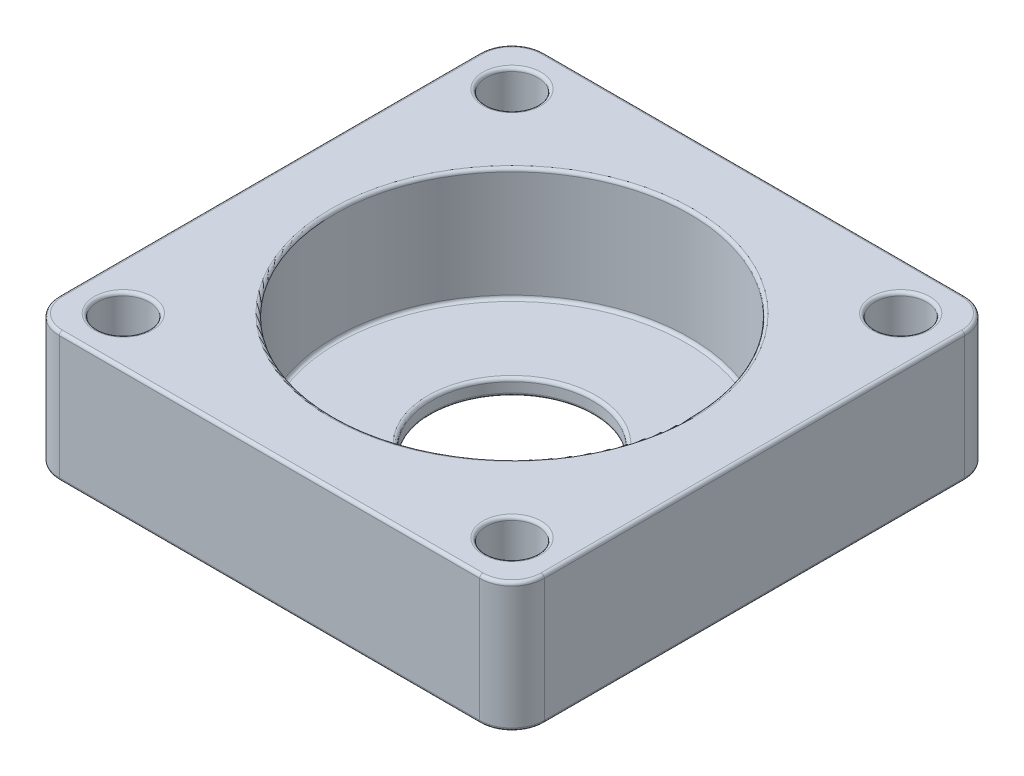
ISO-10303-21;
HEADER;
FILE_DESCRIPTION(('STEP AP214'),'2;1');
FILE_NAME('part.step','',(''),(''),'','','');
FILE_SCHEMA(('AUTOMOTIVE_DESIGN { 1 0 10303 214 1 1 1 1 }'));
ENDSEC;
DATA;
#1=APPLICATION_CONTEXT('core data for automotive mechanical design processes');
#2=APPLICATION_PROTOCOL_DEFINITION('international standard','automotive_design',2000,#1);
#3=PRODUCT_CONTEXT('',#1,'mechanical');
#4=PRODUCT('Part','Part','',(#3));
#5=PRODUCT_RELATED_PRODUCT_CATEGORY('part','',(#4));
#6=PRODUCT_DEFINITION_FORMATION('','',#4);
#7=PRODUCT_DEFINITION_CONTEXT('part definition',#1,'design');
#8=PRODUCT_DEFINITION('design','',#6,#7);
#9=PRODUCT_DEFINITION_SHAPE('','',#8);
#10=(LENGTH_UNIT() NAMED_UNIT(*) SI_UNIT(.MILLI.,.METRE.));
#11=(NAMED_UNIT(*) PLANE_ANGLE_UNIT() SI_UNIT($,.RADIAN.));
#12=(NAMED_UNIT(*) SI_UNIT($,.STERADIAN.) SOLID_ANGLE_UNIT());
#13=UNCERTAINTY_MEASURE_WITH_UNIT(LENGTH_MEASURE(1.E-05),#10,'distance_accuracy_value','');
#14=(GEOMETRIC_REPRESENTATION_CONTEXT(3) GLOBAL_UNCERTAINTY_ASSIGNED_CONTEXT((#13)) GLOBAL_UNIT_ASSIGNED_CONTEXT((#10,
#11,#12)) REPRESENTATION_CONTEXT('',''));
#15=CARTESIAN_POINT('',(0.,0.,0.));
#16=DIRECTION('',(0.,0.,1.));
#17=DIRECTION('',(1.,0.,0.));
#18=AXIS2_PLACEMENT_3D('',#15,#16,#17);
#19=CARTESIAN_POINT('',(0.,-8.,0.));
#20=DIRECTION('',(0.,1.,0.));
#21=DIRECTION('',(0.,0.,1.));
#22=AXIS2_PLACEMENT_3D('',#19,#20,#21);
#23=CYLINDRICAL_SURFACE('',#22,5.);
#24=CARTESIAN_POINT('',(0.,-7.8,0.));
#25=DIRECTION('',(0.,1.,0.));
#26=DIRECTION('',(0.,0.,1.));
#27=AXIS2_PLACEMENT_3D('',#24,#25,#26);
#28=CIRCLE('',#27,5.);
#29=CARTESIAN_POINT('',(0.,-7.8,5.));
#30=VERTEX_POINT('',#29);
#31=EDGE_CURVE('E190',#30,#30,#28,.F.);
#32=ORIENTED_EDGE('',*,*,#31,.T.);
#33=EDGE_LOOP('',(#32));
#34=FACE_BOUND('',#33,.T.);
#35=CARTESIAN_POINT('',(0.,-7.2,0.));
#36=DIRECTION('',(0.,1.,0.));
#37=DIRECTION('',(0.,0.,1.));
#38=AXIS2_PLACEMENT_3D('',#35,#36,#37);
#39=CIRCLE('',#38,5.);
#40=CARTESIAN_POINT('',(0.,-7.2,5.));
#41=VERTEX_POINT('',#40);
#42=EDGE_CURVE('E187',#41,#41,#39,.T.);
#43=ORIENTED_EDGE('',*,*,#42,.T.);
#44=EDGE_LOOP('',(#43));
#45=FACE_BOUND('',#44,.T.);
#46=ADVANCED_FACE('F34',(#34,#45),#23,.F.);
#47=CARTESIAN_POINT('',(15.,-8.,0.));
#48=DIRECTION('',(-1.,0.,0.));
#49=DIRECTION('',(0.,0.,1.));
#50=AXIS2_PLACEMENT_3D('',#47,#48,#49);
#51=PLANE('',#50);
#52=DIRECTION('',(0.,1.,0.));
#53=VECTOR('',#52,1.);
#54=CARTESIAN_POINT('',(15.,-8.,13.));
#55=LINE('',#54,#53);
#56=CARTESIAN_POINT('',(15.,-0.2,13.));
#57=VERTEX_POINT('',#56);
#58=CARTESIAN_POINT('',(15.,-7.8,13.));
#59=VERTEX_POINT('',#58);
#60=EDGE_CURVE('E348',#57,#59,#55,.F.);
#61=ORIENTED_EDGE('',*,*,#60,.T.);
#62=DIRECTION('',(0.,0.,1.));
#63=VECTOR('',#62,1.);
#64=CARTESIAN_POINT('',(15.,-7.8,0.));
#65=LINE('',#64,#63);
#66=CARTESIAN_POINT('',(15.,-7.8,-13.));
#67=VERTEX_POINT('',#66);
#68=EDGE_CURVE('E229',#59,#67,#65,.F.);
#69=ORIENTED_EDGE('',*,*,#68,.T.);
#70=DIRECTION('',(0.,1.,0.));
#71=VECTOR('',#70,1.);
#72=CARTESIAN_POINT('',(15.,-8.,-13.));
#73=LINE('',#72,#71);
#74=CARTESIAN_POINT('',(15.,-0.2,-13.));
#75=VERTEX_POINT('',#74);
#76=EDGE_CURVE('E341',#67,#75,#73,.T.);
#77=ORIENTED_EDGE('',*,*,#76,.T.);
#78=DIRECTION('',(0.,0.,1.));
#79=VECTOR('',#78,1.);
#80=CARTESIAN_POINT('',(15.,-0.2,13.));
#81=LINE('',#80,#79);
#82=EDGE_CURVE('E227',#75,#57,#81,.T.);
#83=ORIENTED_EDGE('',*,*,#82,.T.);
#84=EDGE_LOOP('',(#61,#69,#77,#83));
#85=FACE_BOUND('',#84,.T.);
#86=ADVANCED_FACE('F346',(#85),#51,.F.);
#87=CARTESIAN_POINT('',(0.,-8.,15.));
#88=DIRECTION('',(0.,0.,1.));
#89=DIRECTION('',(1.,0.,0.));
#90=AXIS2_PLACEMENT_3D('',#87,#88,#89);
#91=PLANE('',#90);
#92=DIRECTION('',(0.,1.,0.));
#93=VECTOR('',#92,1.);
#94=CARTESIAN_POINT('',(-13.,-8.,15.));
#95=LINE('',#94,#93);
#96=CARTESIAN_POINT('',(-13.,-0.2,15.));
#97=VERTEX_POINT('',#96);
#98=CARTESIAN_POINT('',(-13.,-7.8,15.));
#99=VERTEX_POINT('',#98);
#100=EDGE_CURVE('E303',#97,#99,#95,.F.);
#101=ORIENTED_EDGE('',*,*,#100,.T.);
#102=DIRECTION('',(1.,0.,0.));
#103=VECTOR('',#102,1.);
#104=CARTESIAN_POINT('',(13.,-7.8,15.));
#105=LINE('',#104,#103);
#106=CARTESIAN_POINT('',(13.,-7.8,15.));
#107=VERTEX_POINT('',#106);
#108=EDGE_CURVE('E221',#99,#107,#105,.T.);
#109=ORIENTED_EDGE('',*,*,#108,.T.);
#110=DIRECTION('',(0.,1.,0.));
#111=VECTOR('',#110,1.);
#112=CARTESIAN_POINT('',(13.,0.,15.));
#113=LINE('',#112,#111);
#114=CARTESIAN_POINT('',(13.,-0.2,15.));
#115=VERTEX_POINT('',#114);
#116=EDGE_CURVE('E349',#107,#115,#113,.T.);
#117=ORIENTED_EDGE('',*,*,#116,.T.);
#118=DIRECTION('',(1.,0.,0.));
#119=VECTOR('',#118,1.);
#120=CARTESIAN_POINT('',(0.,-0.2,15.));
#121=LINE('',#120,#119);
#122=EDGE_CURVE('E219',#115,#97,#121,.F.);
#123=ORIENTED_EDGE('',*,*,#122,.T.);
#124=EDGE_LOOP('',(#101,#109,#117,#123));
#125=FACE_BOUND('',#124,.T.);
#126=ADVANCED_FACE('F422',(#125),#91,.T.);
#127=CARTESIAN_POINT('',(-15.,-8.,0.));
#128=DIRECTION('',(-1.,0.,0.));
#129=DIRECTION('',(0.,0.,1.));
#130=AXIS2_PLACEMENT_3D('',#127,#128,#129);
#131=PLANE('',#130);
#132=DIRECTION('',(0.,1.,0.));
#133=VECTOR('',#132,1.);
#134=CARTESIAN_POINT('',(-15.,-8.,-13.));
#135=LINE('',#134,#133);
#136=CARTESIAN_POINT('',(-15.,-0.2,-13.));
#137=VERTEX_POINT('',#136);
#138=CARTESIAN_POINT('',(-15.,-7.8,-13.));
#139=VERTEX_POINT('',#138);
#140=EDGE_CURVE('E351',#137,#139,#135,.F.);
#141=ORIENTED_EDGE('',*,*,#140,.T.);
#142=DIRECTION('',(0.,0.,1.));
#143=VECTOR('',#142,1.);
#144=CARTESIAN_POINT('',(-15.,-7.8,13.));
#145=LINE('',#144,#143);
#146=CARTESIAN_POINT('',(-15.,-7.8,13.));
#147=VERTEX_POINT('',#146);
#148=EDGE_CURVE('E212',#139,#147,#145,.T.);
#149=ORIENTED_EDGE('',*,*,#148,.T.);
#150=DIRECTION('',(0.,1.,0.));
#151=VECTOR('',#150,1.);
#152=CARTESIAN_POINT('',(-15.,-8.,13.));
#153=LINE('',#152,#151);
#154=CARTESIAN_POINT('',(-15.,-0.2,13.));
#155=VERTEX_POINT('',#154);
#156=EDGE_CURVE('E359',#147,#155,#153,.T.);
#157=ORIENTED_EDGE('',*,*,#156,.T.);
#158=DIRECTION('',(0.,0.,1.));
#159=VECTOR('',#158,1.);
#160=CARTESIAN_POINT('',(-15.,-0.2,0.));
#161=LINE('',#160,#159);
#162=EDGE_CURVE('E210',#155,#137,#161,.F.);
#163=ORIENTED_EDGE('',*,*,#162,.T.);
#164=EDGE_LOOP('',(#141,#149,#157,#163));
#165=FACE_BOUND('',#164,.T.);
#166=ADVANCED_FACE('F438',(#165),#131,.T.);
#167=CARTESIAN_POINT('',(-12.0208152801713,-8.,12.0208152801713));
#168=DIRECTION('',(0.,1.,0.));
#169=DIRECTION('',(0.,0.,1.));
#170=AXIS2_PLACEMENT_3D('',#167,#168,#169);
#171=CYLINDRICAL_SURFACE('',#170,1.6);
#172=CARTESIAN_POINT('',(-12.0208152801713,-7.8,12.0208152801713));
#173=DIRECTION('',(0.,1.,0.));
#174=DIRECTION('',(0.,0.,1.));
#175=AXIS2_PLACEMENT_3D('',#172,#173,#174);
#176=CIRCLE('',#175,1.6);
#177=CARTESIAN_POINT('',(-12.0208152801713,-7.8,13.6208152801713));
#178=VERTEX_POINT('',#177);
#179=EDGE_CURVE('E196',#178,#178,#176,.F.);
#180=ORIENTED_EDGE('',*,*,#179,.T.);
#181=EDGE_LOOP('',(#180));
#182=FACE_BOUND('',#181,.T.);
#183=CARTESIAN_POINT('',(-12.0208152801713,-0.2,12.0208152801713));
#184=DIRECTION('',(0.,1.,0.));
#185=DIRECTION('',(0.,0.,1.));
#186=AXIS2_PLACEMENT_3D('',#183,#184,#185);
#187=CIRCLE('',#186,1.6);
#188=CARTESIAN_POINT('',(-12.0208152801713,-0.2,13.6208152801713));
#189=VERTEX_POINT('',#188);
#190=EDGE_CURVE('E193',#189,#189,#187,.T.);
#191=ORIENTED_EDGE('',*,*,#190,.T.);
#192=EDGE_LOOP('',(#191));
#193=FACE_BOUND('',#192,.T.);
#194=ADVANCED_FACE('F440',(#182,#193),#171,.F.);
#195=CARTESIAN_POINT('',(0.,-8.,-15.));
#196=DIRECTION('',(0.,0.,1.));
#197=DIRECTION('',(1.,0.,0.));
#198=AXIS2_PLACEMENT_3D('',#195,#196,#197);
#199=PLANE('',#198);
#200=DIRECTION('',(0.,1.,0.));
#201=VECTOR('',#200,1.);
#202=CARTESIAN_POINT('',(13.,-8.,-15.));
#203=LINE('',#202,#201);
#204=CARTESIAN_POINT('',(13.,-0.2,-15.));
#205=VERTEX_POINT('',#204);
#206=CARTESIAN_POINT('',(13.,-7.8,-15.));
#207=VERTEX_POINT('',#206);
#208=EDGE_CURVE('E343',#205,#207,#203,.F.);
#209=ORIENTED_EDGE('',*,*,#208,.T.);
#210=DIRECTION('',(1.,0.,0.));
#211=VECTOR('',#210,1.);
#212=CARTESIAN_POINT('',(0.,-7.8,-15.));
#213=LINE('',#212,#211);
#214=CARTESIAN_POINT('',(-13.,-7.8,-15.));
#215=VERTEX_POINT('',#214);
#216=EDGE_CURVE('E204',#207,#215,#213,.F.);
#217=ORIENTED_EDGE('',*,*,#216,.T.);
#218=DIRECTION('',(0.,1.,0.));
#219=VECTOR('',#218,1.);
#220=CARTESIAN_POINT('',(-13.,0.,-15.));
#221=LINE('',#220,#219);
#222=CARTESIAN_POINT('',(-13.,-0.2,-15.));
#223=VERTEX_POINT('',#222);
#224=EDGE_CURVE('E363',#215,#223,#221,.T.);
#225=ORIENTED_EDGE('',*,*,#224,.T.);
#226=DIRECTION('',(1.,0.,0.));
#227=VECTOR('',#226,1.);
#228=CARTESIAN_POINT('',(13.,-0.2,-15.));
#229=LINE('',#228,#227);
#230=EDGE_CURVE('E202',#223,#205,#229,.T.);
#231=ORIENTED_EDGE('',*,*,#230,.T.);
#232=EDGE_LOOP('',(#209,#217,#225,#231));
#233=FACE_BOUND('',#232,.T.);
#234=ADVANCED_FACE('F392',(#233),#199,.F.);
#235=CARTESIAN_POINT('',(-12.0208152801713,-8.,-12.0208152801713));
#236=DIRECTION('',(0.,1.,0.));
#237=DIRECTION('',(0.,0.,1.));
#238=AXIS2_PLACEMENT_3D('',#235,#236,#237);
#239=CYLINDRICAL_SURFACE('',#238,1.6);
#240=CARTESIAN_POINT('',(-12.0208152801713,-7.8,-12.0208152801713));
#241=DIRECTION('',(0.,1.,0.));
#242=DIRECTION('',(0.,0.,1.));
#243=AXIS2_PLACEMENT_3D('',#240,#241,#242);
#244=CIRCLE('',#243,1.6);
#245=CARTESIAN_POINT('',(-12.0208152801713,-7.8,-10.4208152801713));
#246=VERTEX_POINT('',#245);
#247=EDGE_CURVE('E234',#246,#246,#244,.F.);
#248=ORIENTED_EDGE('',*,*,#247,.T.);
#249=EDGE_LOOP('',(#248));
#250=FACE_BOUND('',#249,.T.);
#251=CARTESIAN_POINT('',(-12.0208152801713,-0.2,-12.0208152801713));
#252=DIRECTION('',(0.,1.,0.));
#253=DIRECTION('',(0.,0.,1.));
#254=AXIS2_PLACEMENT_3D('',#251,#252,#253);
#255=CIRCLE('',#254,1.6);
#256=CARTESIAN_POINT('',(-12.0208152801713,-0.2,-10.4208152801713));
#257=VERTEX_POINT('',#256);
#258=EDGE_CURVE('E231',#257,#257,#255,.T.);
#259=ORIENTED_EDGE('',*,*,#258,.T.);
#260=EDGE_LOOP('',(#259));
#261=FACE_BOUND('',#260,.T.);
#262=ADVANCED_FACE('F549',(#250,#261),#239,.F.);
#263=CARTESIAN_POINT('',(12.0208152801713,-8.,-12.0208152801713));
#264=DIRECTION('',(0.,1.,0.));
#265=DIRECTION('',(0.,0.,1.));
#266=AXIS2_PLACEMENT_3D('',#263,#264,#265);
#267=CYLINDRICAL_SURFACE('',#266,1.6);
#268=CARTESIAN_POINT('',(12.0208152801713,-7.8,-12.0208152801713));
#269=DIRECTION('',(0.,1.,0.));
#270=DIRECTION('',(0.,0.,1.));
#271=AXIS2_PLACEMENT_3D('',#268,#269,#270);
#272=CIRCLE('',#271,1.6);
#273=CARTESIAN_POINT('',(12.0208152801713,-7.8,-10.4208152801713));
#274=VERTEX_POINT('',#273);
#275=EDGE_CURVE('E240',#274,#274,#272,.F.);
#276=ORIENTED_EDGE('',*,*,#275,.T.);
#277=EDGE_LOOP('',(#276));
#278=FACE_BOUND('',#277,.T.);
#279=CARTESIAN_POINT('',(12.0208152801713,-0.2,-12.0208152801713));
#280=DIRECTION('',(0.,1.,0.));
#281=DIRECTION('',(0.,0.,1.));
#282=AXIS2_PLACEMENT_3D('',#279,#280,#281);
#283=CIRCLE('',#282,1.6);
#284=CARTESIAN_POINT('',(12.0208152801713,-0.2,-10.4208152801713));
#285=VERTEX_POINT('',#284);
#286=EDGE_CURVE('E237',#285,#285,#283,.T.);
#287=ORIENTED_EDGE('',*,*,#286,.T.);
#288=EDGE_LOOP('',(#287));
#289=FACE_BOUND('',#288,.T.);
#290=ADVANCED_FACE('F543',(#278,#289),#267,.F.);
#291=CARTESIAN_POINT('',(12.0208152801713,-8.,12.0208152801713));
#292=DIRECTION('',(0.,1.,0.));
#293=DIRECTION('',(0.,0.,1.));
#294=AXIS2_PLACEMENT_3D('',#291,#292,#293);
#295=CYLINDRICAL_SURFACE('',#294,1.6);
#296=CARTESIAN_POINT('',(12.0208152801713,-7.8,12.0208152801713));
#297=DIRECTION('',(0.,1.,0.));
#298=DIRECTION('',(0.,0.,1.));
#299=AXIS2_PLACEMENT_3D('',#296,#297,#298);
#300=CIRCLE('',#299,1.6);
#301=CARTESIAN_POINT('',(12.0208152801713,-7.8,13.6208152801713));
#302=VERTEX_POINT('',#301);
#303=EDGE_CURVE('E246',#302,#302,#300,.F.);
#304=ORIENTED_EDGE('',*,*,#303,.T.);
#305=EDGE_LOOP('',(#304));
#306=FACE_BOUND('',#305,.T.);
#307=CARTESIAN_POINT('',(12.0208152801713,-0.2,12.0208152801713));
#308=DIRECTION('',(0.,1.,0.));
#309=DIRECTION('',(0.,0.,1.));
#310=AXIS2_PLACEMENT_3D('',#307,#308,#309);
#311=CIRCLE('',#310,1.6);
#312=CARTESIAN_POINT('',(12.0208152801713,-0.2,13.6208152801713));
#313=VERTEX_POINT('',#312);
#314=EDGE_CURVE('E243',#313,#313,#311,.T.);
#315=ORIENTED_EDGE('',*,*,#314,.T.);
#316=EDGE_LOOP('',(#315));
#317=FACE_BOUND('',#316,.T.);
#318=ADVANCED_FACE('F465',(#306,#317),#295,.F.);
#319=CARTESIAN_POINT('',(0.,-8.,0.));
#320=DIRECTION('',(0.,1.,0.));
#321=DIRECTION('',(0.,0.,1.));
#322=AXIS2_PLACEMENT_3D('',#319,#320,#321);
#323=PLANE('',#322);
#324=CARTESIAN_POINT('',(0.,-8.,0.));
#325=DIRECTION('',(0.,1.,0.));
#326=DIRECTION('',(0.,0.,1.));
#327=AXIS2_PLACEMENT_3D('',#324,#325,#326);
#328=CIRCLE('',#327,5.2);
#329=CARTESIAN_POINT('',(0.,-8.,5.2));
#330=VERTEX_POINT('',#329);
#331=EDGE_CURVE('E179',#330,#330,#328,.T.);
#332=ORIENTED_EDGE('',*,*,#331,.T.);
#333=EDGE_LOOP('',(#332));
#334=FACE_BOUND('',#333,.T.);
#335=CARTESIAN_POINT('',(-12.0208152801713,-8.,12.0208152801713));
#336=DIRECTION('',(0.,1.,0.));
#337=DIRECTION('',(0.,0.,1.));
#338=AXIS2_PLACEMENT_3D('',#335,#336,#337);
#339=CIRCLE('',#338,1.8);
#340=CARTESIAN_POINT('',(-12.0208152801713,-8.,13.8208152801713));
#341=VERTEX_POINT('',#340);
#342=EDGE_CURVE('E176',#341,#341,#339,.T.);
#343=ORIENTED_EDGE('',*,*,#342,.T.);
#344=EDGE_LOOP('',(#343));
#345=FACE_BOUND('',#344,.T.);
#346=DIRECTION('',(1.,0.,0.));
#347=VECTOR('',#346,1.);
#348=CARTESIAN_POINT('',(0.,-8.,-14.8));
#349=LINE('',#348,#347);
#350=CARTESIAN_POINT('',(-13.,-8.,-14.8));
#351=VERTEX_POINT('',#350);
#352=CARTESIAN_POINT('',(13.,-8.,-14.8));
#353=VERTEX_POINT('',#352);
#354=EDGE_CURVE('E174',#351,#353,#349,.T.);
#355=ORIENTED_EDGE('',*,*,#354,.T.);
#356=CARTESIAN_POINT('',(13.,-8.,-13.));
#357=DIRECTION('',(0.,1.,0.));
#358=DIRECTION('',(0.,0.,1.));
#359=AXIS2_PLACEMENT_3D('',#356,#357,#358);
#360=CIRCLE('',#359,1.8);
#361=CARTESIAN_POINT('',(14.8,-8.,-13.));
#362=VERTEX_POINT('',#361);
#363=EDGE_CURVE('E154',#353,#362,#360,.F.);
#364=ORIENTED_EDGE('',*,*,#363,.T.);
#365=DIRECTION('',(0.,0.,1.));
#366=VECTOR('',#365,1.);
#367=CARTESIAN_POINT('',(14.8,-8.,0.));
#368=LINE('',#367,#366);
#369=CARTESIAN_POINT('',(14.8,-8.,13.));
#370=VERTEX_POINT('',#369);
#371=EDGE_CURVE('E162',#362,#370,#368,.T.);
#372=ORIENTED_EDGE('',*,*,#371,.T.);
#373=CARTESIAN_POINT('',(13.,-8.,13.));
#374=DIRECTION('',(0.,1.,0.));
#375=DIRECTION('',(0.,0.,1.));
#376=AXIS2_PLACEMENT_3D('',#373,#374,#375);
#377=CIRCLE('',#376,1.8);
#378=CARTESIAN_POINT('',(13.,-8.,14.8));
#379=VERTEX_POINT('',#378);
#380=EDGE_CURVE('E168',#370,#379,#377,.F.);
#381=ORIENTED_EDGE('',*,*,#380,.T.);
#382=DIRECTION('',(1.,0.,0.));
#383=VECTOR('',#382,1.);
#384=CARTESIAN_POINT('',(-13.,-8.,14.8));
#385=LINE('',#384,#383);
#386=CARTESIAN_POINT('',(-13.,-8.,14.8));
#387=VERTEX_POINT('',#386);
#388=EDGE_CURVE('E375',#379,#387,#385,.F.);
#389=ORIENTED_EDGE('',*,*,#388,.T.);
#390=CARTESIAN_POINT('',(-13.,-8.,13.));
#391=DIRECTION('',(0.,1.,0.));
#392=DIRECTION('',(0.,0.,1.));
#393=AXIS2_PLACEMENT_3D('',#390,#391,#392);
#394=CIRCLE('',#393,1.8);
#395=CARTESIAN_POINT('',(-14.8,-8.,13.));
#396=VERTEX_POINT('',#395);
#397=EDGE_CURVE('E377',#387,#396,#394,.F.);
#398=ORIENTED_EDGE('',*,*,#397,.T.);
#399=DIRECTION('',(0.,0.,1.));
#400=VECTOR('',#399,1.);
#401=CARTESIAN_POINT('',(-14.8,-8.,-13.));
#402=LINE('',#401,#400);
#403=CARTESIAN_POINT('',(-14.8,-8.,-13.));
#404=VERTEX_POINT('',#403);
#405=EDGE_CURVE('E379',#396,#404,#402,.F.);
#406=ORIENTED_EDGE('',*,*,#405,.T.);
#407=CARTESIAN_POINT('',(-13.,-8.,-13.));
#408=DIRECTION('',(0.,1.,0.));
#409=DIRECTION('',(0.,0.,1.));
#410=AXIS2_PLACEMENT_3D('',#407,#408,#409);
#411=CIRCLE('',#410,1.8);
#412=EDGE_CURVE('E181',#404,#351,#411,.F.);
#413=ORIENTED_EDGE('',*,*,#412,.T.);
#414=EDGE_LOOP('',(#355,#364,#372,#381,#389,#398,#406,#413));
#415=FACE_BOUND('',#414,.T.);
#416=CARTESIAN_POINT('',(-12.0208152801713,-8.,-12.0208152801713));
#417=DIRECTION('',(0.,1.,0.));
#418=DIRECTION('',(0.,0.,1.));
#419=AXIS2_PLACEMENT_3D('',#416,#417,#418);
#420=CIRCLE('',#419,1.8);
#421=CARTESIAN_POINT('',(-12.0208152801713,-8.,-10.2208152801713));
#422=VERTEX_POINT('',#421);
#423=EDGE_CURVE('E169',#422,#422,#420,.T.);
#424=ORIENTED_EDGE('',*,*,#423,.T.);
#425=EDGE_LOOP('',(#424));
#426=FACE_BOUND('',#425,.T.);
#427=CARTESIAN_POINT('',(12.0208152801713,-8.,-12.0208152801713));
#428=DIRECTION('',(0.,1.,0.));
#429=DIRECTION('',(0.,0.,1.));
#430=AXIS2_PLACEMENT_3D('',#427,#428,#429);
#431=CIRCLE('',#430,1.8);
#432=CARTESIAN_POINT('',(12.0208152801713,-8.,-10.2208152801713));
#433=VERTEX_POINT('',#432);
#434=EDGE_CURVE('E369',#433,#433,#431,.T.);
#435=ORIENTED_EDGE('',*,*,#434,.T.);
#436=EDGE_LOOP('',(#435));
#437=FACE_BOUND('',#436,.T.);
#438=CARTESIAN_POINT('',(12.0208152801713,-8.,12.0208152801713));
#439=DIRECTION('',(0.,1.,0.));
#440=DIRECTION('',(0.,0.,1.));
#441=AXIS2_PLACEMENT_3D('',#438,#439,#440);
#442=CIRCLE('',#441,1.8);
#443=CARTESIAN_POINT('',(12.0208152801713,-8.,13.8208152801713));
#444=VERTEX_POINT('',#443);
#445=EDGE_CURVE('E366',#444,#444,#442,.T.);
#446=ORIENTED_EDGE('',*,*,#445,.T.);
#447=EDGE_LOOP('',(#446));
#448=FACE_BOUND('',#447,.T.);
#449=ADVANCED_FACE('F171',(#334,#345,#415,#426,#437,#448),#323,.F.);
#450=CARTESIAN_POINT('',(0.,0.,0.));
#451=DIRECTION('',(0.,1.,0.));
#452=DIRECTION('',(0.,0.,1.));
#453=AXIS2_PLACEMENT_3D('',#450,#451,#452);
#454=PLANE('',#453);
#455=CARTESIAN_POINT('',(-12.0208152801713,0.,12.0208152801713));
#456=DIRECTION('',(0.,1.,0.));
#457=DIRECTION('',(0.,0.,1.));
#458=AXIS2_PLACEMENT_3D('',#455,#456,#457);
#459=CIRCLE('',#458,1.8);
#460=CARTESIAN_POINT('',(-12.0208152801713,0.,13.8208152801713));
#461=VERTEX_POINT('',#460);
#462=EDGE_CURVE('E11',#461,#461,#459,.F.);
#463=ORIENTED_EDGE('',*,*,#462,.T.);
#464=EDGE_LOOP('',(#463));
#465=FACE_BOUND('',#464,.T.);
#466=DIRECTION('',(0.,0.,1.));
#467=VECTOR('',#466,1.);
#468=CARTESIAN_POINT('',(-14.8,0.,0.));
#469=LINE('',#468,#467);
#470=CARTESIAN_POINT('',(-14.8,0.,-13.));
#471=VERTEX_POINT('',#470);
#472=CARTESIAN_POINT('',(-14.8,0.,13.));
#473=VERTEX_POINT('',#472);
#474=EDGE_CURVE('E51',#471,#473,#469,.T.);
#475=ORIENTED_EDGE('',*,*,#474,.T.);
#476=CARTESIAN_POINT('',(-13.,0.,13.));
#477=DIRECTION('',(0.,1.,0.));
#478=DIRECTION('',(0.,0.,1.));
#479=AXIS2_PLACEMENT_3D('',#476,#477,#478);
#480=CIRCLE('',#479,1.8);
#481=CARTESIAN_POINT('',(-13.,0.,14.8));
#482=VERTEX_POINT('',#481);
#483=EDGE_CURVE('E43',#473,#482,#480,.T.);
#484=ORIENTED_EDGE('',*,*,#483,.T.);
#485=DIRECTION('',(1.,0.,0.));
#486=VECTOR('',#485,1.);
#487=CARTESIAN_POINT('',(0.,0.,14.8));
#488=LINE('',#487,#486);
#489=CARTESIAN_POINT('',(13.,0.,14.8));
#490=VERTEX_POINT('',#489);
#491=EDGE_CURVE('E273',#482,#490,#488,.T.);
#492=ORIENTED_EDGE('',*,*,#491,.T.);
#493=CARTESIAN_POINT('',(13.,0.,13.));
#494=DIRECTION('',(0.,1.,0.));
#495=DIRECTION('',(0.,0.,1.));
#496=AXIS2_PLACEMENT_3D('',#493,#494,#495);
#497=CIRCLE('',#496,1.8);
#498=CARTESIAN_POINT('',(14.8,0.,13.));
#499=VERTEX_POINT('',#498);
#500=EDGE_CURVE('E275',#490,#499,#497,.T.);
#501=ORIENTED_EDGE('',*,*,#500,.T.);
#502=DIRECTION('',(0.,0.,1.));
#503=VECTOR('',#502,1.);
#504=CARTESIAN_POINT('',(14.8,0.,-13.));
#505=LINE('',#504,#503);
#506=CARTESIAN_POINT('',(14.8,0.,-13.));
#507=VERTEX_POINT('',#506);
#508=EDGE_CURVE('E277',#499,#507,#505,.F.);
#509=ORIENTED_EDGE('',*,*,#508,.T.);
#510=CARTESIAN_POINT('',(13.,0.,-13.));
#511=DIRECTION('',(0.,1.,0.));
#512=DIRECTION('',(0.,0.,1.));
#513=AXIS2_PLACEMENT_3D('',#510,#511,#512);
#514=CIRCLE('',#513,1.8);
#515=CARTESIAN_POINT('',(13.,0.,-14.8));
#516=VERTEX_POINT('',#515);
#517=EDGE_CURVE('E279',#507,#516,#514,.T.);
#518=ORIENTED_EDGE('',*,*,#517,.T.);
#519=DIRECTION('',(1.,0.,0.));
#520=VECTOR('',#519,1.);
#521=CARTESIAN_POINT('',(-13.,0.,-14.8));
#522=LINE('',#521,#520);
#523=CARTESIAN_POINT('',(-13.,0.,-14.8));
#524=VERTEX_POINT('',#523);
#525=EDGE_CURVE('E281',#516,#524,#522,.F.);
#526=ORIENTED_EDGE('',*,*,#525,.T.);
#527=CARTESIAN_POINT('',(-13.,0.,-13.));
#528=DIRECTION('',(0.,1.,0.));
#529=DIRECTION('',(0.,0.,1.));
#530=AXIS2_PLACEMENT_3D('',#527,#528,#529);
#531=CIRCLE('',#530,1.8);
#532=EDGE_CURVE('E56',#524,#471,#531,.T.);
#533=ORIENTED_EDGE('',*,*,#532,.T.);
#534=EDGE_LOOP('',(#475,#484,#492,#501,#509,#518,#526,#533));
#535=FACE_BOUND('',#534,.T.);
#536=CARTESIAN_POINT('',(-12.0208152801713,0.,-12.0208152801713));
#537=DIRECTION('',(0.,1.,0.));
#538=DIRECTION('',(0.,0.,1.));
#539=AXIS2_PLACEMENT_3D('',#536,#537,#538);
#540=CIRCLE('',#539,1.8);
#541=CARTESIAN_POINT('',(-12.0208152801713,0.,-10.2208152801713));
#542=VERTEX_POINT('',#541);
#543=EDGE_CURVE('E270',#542,#542,#540,.F.);
#544=ORIENTED_EDGE('',*,*,#543,.T.);
#545=EDGE_LOOP('',(#544));
#546=FACE_BOUND('',#545,.T.);
#547=CARTESIAN_POINT('',(12.0208152801713,0.,-12.0208152801713));
#548=DIRECTION('',(0.,1.,0.));
#549=DIRECTION('',(0.,0.,1.));
#550=AXIS2_PLACEMENT_3D('',#547,#548,#549);
#551=CIRCLE('',#550,1.8);
#552=CARTESIAN_POINT('',(12.0208152801713,0.,-10.2208152801713));
#553=VERTEX_POINT('',#552);
#554=EDGE_CURVE('E267',#553,#553,#551,.F.);
#555=ORIENTED_EDGE('',*,*,#554,.T.);
#556=EDGE_LOOP('',(#555));
#557=FACE_BOUND('',#556,.T.);
#558=CARTESIAN_POINT('',(12.0208152801713,0.,12.0208152801713));
#559=DIRECTION('',(0.,1.,0.));
#560=DIRECTION('',(0.,0.,1.));
#561=AXIS2_PLACEMENT_3D('',#558,#559,#560);
#562=CIRCLE('',#561,1.8);
#563=CARTESIAN_POINT('',(12.0208152801713,0.,13.8208152801713));
#564=VERTEX_POINT('',#563);
#565=EDGE_CURVE('E264',#564,#564,#562,.F.);
#566=ORIENTED_EDGE('',*,*,#565,.T.);
#567=EDGE_LOOP('',(#566));
#568=FACE_BOUND('',#567,.T.);
#569=CARTESIAN_POINT('',(0.,0.,0.));
#570=DIRECTION('',(0.,1.,0.));
#571=DIRECTION('',(0.,0.,1.));
#572=AXIS2_PLACEMENT_3D('',#569,#570,#571);
#573=CIRCLE('',#572,11.2);
#574=CARTESIAN_POINT('',(0.,0.,11.2));
#575=VERTEX_POINT('',#574);
#576=EDGE_CURVE('E261',#575,#575,#573,.F.);
#577=ORIENTED_EDGE('',*,*,#576,.T.);
#578=EDGE_LOOP('',(#577));
#579=FACE_BOUND('',#578,.T.);
#580=ADVANCED_FACE('F408',(#465,#535,#546,#557,#568,#579),#454,.T.);
#581=CARTESIAN_POINT('',(0.,-7.,0.));
#582=DIRECTION('',(0.,1.,0.));
#583=DIRECTION('',(0.,0.,1.));
#584=AXIS2_PLACEMENT_3D('',#581,#582,#583);
#585=CYLINDRICAL_SURFACE('',#584,11.);
#586=CARTESIAN_POINT('',(0.,-6.8,0.));
#587=DIRECTION('',(0.,1.,0.));
#588=DIRECTION('',(0.,0.,1.));
#589=AXIS2_PLACEMENT_3D('',#586,#587,#588);
#590=CIRCLE('',#589,11.);
#591=CARTESIAN_POINT('',(0.,-6.8,11.));
#592=VERTEX_POINT('',#591);
#593=EDGE_CURVE('E258',#592,#592,#590,.F.);
#594=ORIENTED_EDGE('',*,*,#593,.T.);
#595=EDGE_LOOP('',(#594));
#596=FACE_BOUND('',#595,.T.);
#597=CARTESIAN_POINT('',(0.,-0.2,0.));
#598=DIRECTION('',(0.,1.,0.));
#599=DIRECTION('',(0.,0.,1.));
#600=AXIS2_PLACEMENT_3D('',#597,#598,#599);
#601=CIRCLE('',#600,11.);
#602=CARTESIAN_POINT('',(0.,-0.2,11.));
#603=VERTEX_POINT('',#602);
#604=EDGE_CURVE('E255',#603,#603,#601,.T.);
#605=ORIENTED_EDGE('',*,*,#604,.T.);
#606=EDGE_LOOP('',(#605));
#607=FACE_BOUND('',#606,.T.);
#608=ADVANCED_FACE('F461',(#596,#607),#585,.F.);
#609=CARTESIAN_POINT('',(0.,-7.,0.));
#610=DIRECTION('',(0.,1.,0.));
#611=DIRECTION('',(0.,0.,1.));
#612=AXIS2_PLACEMENT_3D('',#609,#610,#611);
#613=PLANE('',#612);
#614=CARTESIAN_POINT('',(0.,-7.,0.));
#615=DIRECTION('',(0.,1.,0.));
#616=DIRECTION('',(0.,0.,1.));
#617=AXIS2_PLACEMENT_3D('',#614,#615,#616);
#618=CIRCLE('',#617,10.8);
#619=CARTESIAN_POINT('',(0.,-7.,10.8));
#620=VERTEX_POINT('',#619);
#621=EDGE_CURVE('E252',#620,#620,#618,.T.);
#622=ORIENTED_EDGE('',*,*,#621,.T.);
#623=EDGE_LOOP('',(#622));
#624=FACE_BOUND('',#623,.T.);
#625=CARTESIAN_POINT('',(0.,-7.,0.));
#626=DIRECTION('',(0.,1.,0.));
#627=DIRECTION('',(0.,0.,1.));
#628=AXIS2_PLACEMENT_3D('',#625,#626,#627);
#629=CIRCLE('',#628,5.2);
#630=CARTESIAN_POINT('',(0.,-7.,5.2));
#631=VERTEX_POINT('',#630);
#632=EDGE_CURVE('E249',#631,#631,#629,.F.);
#633=ORIENTED_EDGE('',*,*,#632,.T.);
#634=EDGE_LOOP('',(#633));
#635=FACE_BOUND('',#634,.T.);
#636=ADVANCED_FACE('F469',(#624,#635),#613,.T.);
#637=CARTESIAN_POINT('',(13.,-8.,13.));
#638=DIRECTION('',(0.,-1.,0.));
#639=DIRECTION('',(0.,0.,-1.));
#640=AXIS2_PLACEMENT_3D('',#637,#638,#639);
#641=CYLINDRICAL_SURFACE('',#640,2.);
#642=ORIENTED_EDGE('',*,*,#116,.F.);
#643=CARTESIAN_POINT('',(13.,-7.8,13.));
#644=DIRECTION('',(0.,1.,0.));
#645=DIRECTION('',(0.,0.,1.));
#646=AXIS2_PLACEMENT_3D('',#643,#644,#645);
#647=CIRCLE('',#646,2.);
#648=EDGE_CURVE('E225',#107,#59,#647,.T.);
#649=ORIENTED_EDGE('',*,*,#648,.T.);
#650=ORIENTED_EDGE('',*,*,#60,.F.);
#651=CARTESIAN_POINT('',(13.,-0.2,13.));
#652=DIRECTION('',(0.,1.,0.));
#653=DIRECTION('',(0.,0.,1.));
#654=AXIS2_PLACEMENT_3D('',#651,#652,#653);
#655=CIRCLE('',#654,2.);
#656=EDGE_CURVE('E223',#57,#115,#655,.F.);
#657=ORIENTED_EDGE('',*,*,#656,.T.);
#658=EDGE_LOOP('',(#642,#649,#650,#657));
#659=FACE_BOUND('',#658,.T.);
#660=ADVANCED_FACE('F472',(#659),#641,.T.);
#661=CARTESIAN_POINT('',(-13.,-8.,13.));
#662=DIRECTION('',(0.,1.,0.));
#663=DIRECTION('',(0.,0.,1.));
#664=AXIS2_PLACEMENT_3D('',#661,#662,#663);
#665=CYLINDRICAL_SURFACE('',#664,2.);
#666=ORIENTED_EDGE('',*,*,#156,.F.);
#667=CARTESIAN_POINT('',(-13.,-7.8,13.));
#668=DIRECTION('',(0.,1.,0.));
#669=DIRECTION('',(0.,0.,1.));
#670=AXIS2_PLACEMENT_3D('',#667,#668,#669);
#671=CIRCLE('',#670,2.);
#672=EDGE_CURVE('E217',#147,#99,#671,.T.);
#673=ORIENTED_EDGE('',*,*,#672,.T.);
#674=ORIENTED_EDGE('',*,*,#100,.F.);
#675=CARTESIAN_POINT('',(-13.,-0.2,13.));
#676=DIRECTION('',(0.,1.,0.));
#677=DIRECTION('',(0.,0.,1.));
#678=AXIS2_PLACEMENT_3D('',#675,#676,#677);
#679=CIRCLE('',#678,2.);
#680=EDGE_CURVE('E214',#97,#155,#679,.F.);
#681=ORIENTED_EDGE('',*,*,#680,.T.);
#682=EDGE_LOOP('',(#666,#673,#674,#681));
#683=FACE_BOUND('',#682,.T.);
#684=ADVANCED_FACE('F427',(#683),#665,.T.);
#685=CARTESIAN_POINT('',(-13.,-8.,-13.));
#686=DIRECTION('',(0.,-1.,0.));
#687=DIRECTION('',(0.,0.,-1.));
#688=AXIS2_PLACEMENT_3D('',#685,#686,#687);
#689=CYLINDRICAL_SURFACE('',#688,2.);
#690=ORIENTED_EDGE('',*,*,#224,.F.);
#691=CARTESIAN_POINT('',(-13.,-7.8,-13.));
#692=DIRECTION('',(0.,1.,0.));
#693=DIRECTION('',(0.,0.,1.));
#694=AXIS2_PLACEMENT_3D('',#691,#692,#693);
#695=CIRCLE('',#694,2.);
#696=EDGE_CURVE('E208',#215,#139,#695,.T.);
#697=ORIENTED_EDGE('',*,*,#696,.T.);
#698=ORIENTED_EDGE('',*,*,#140,.F.);
#699=CARTESIAN_POINT('',(-13.,-0.2,-13.));
#700=DIRECTION('',(0.,1.,0.));
#701=DIRECTION('',(0.,0.,1.));
#702=AXIS2_PLACEMENT_3D('',#699,#700,#701);
#703=CIRCLE('',#702,2.);
#704=EDGE_CURVE('E206',#137,#223,#703,.F.);
#705=ORIENTED_EDGE('',*,*,#704,.T.);
#706=EDGE_LOOP('',(#690,#697,#698,#705));
#707=FACE_BOUND('',#706,.T.);
#708=ADVANCED_FACE('F394',(#707),#689,.T.);
#709=CARTESIAN_POINT('',(13.,-8.,-13.));
#710=DIRECTION('',(0.,1.,0.));
#711=DIRECTION('',(0.,0.,1.));
#712=AXIS2_PLACEMENT_3D('',#709,#710,#711);
#713=CYLINDRICAL_SURFACE('',#712,2.);
#714=ORIENTED_EDGE('',*,*,#76,.F.);
#715=CARTESIAN_POINT('',(13.,-7.8,-13.));
#716=DIRECTION('',(0.,1.,0.));
#717=DIRECTION('',(0.,0.,1.));
#718=AXIS2_PLACEMENT_3D('',#715,#716,#717);
#719=CIRCLE('',#718,2.);
#720=EDGE_CURVE('E156',#67,#207,#719,.T.);
#721=ORIENTED_EDGE('',*,*,#720,.T.);
#722=ORIENTED_EDGE('',*,*,#208,.F.);
#723=CARTESIAN_POINT('',(13.,-0.2,-13.));
#724=DIRECTION('',(0.,1.,0.));
#725=DIRECTION('',(0.,0.,1.));
#726=AXIS2_PLACEMENT_3D('',#723,#724,#725);
#727=CIRCLE('',#726,2.);
#728=EDGE_CURVE('E199',#205,#75,#727,.F.);
#729=ORIENTED_EDGE('',*,*,#728,.T.);
#730=EDGE_LOOP('',(#714,#721,#722,#729));
#731=FACE_BOUND('',#730,.T.);
#732=ADVANCED_FACE('F340',(#731),#713,.T.);
#733=CARTESIAN_POINT('',(0.,-7.8,0.));
#734=DIRECTION('',(0.,1.,0.));
#735=DIRECTION('',(0.,0.,1.));
#736=AXIS2_PLACEMENT_3D('',#733,#734,#735);
#737=TOROIDAL_SURFACE('',#736,5.2,0.2);
#738=ORIENTED_EDGE('',*,*,#31,.F.);
#739=EDGE_LOOP('',(#738));
#740=FACE_BOUND('',#739,.T.);
#741=ORIENTED_EDGE('',*,*,#331,.F.);
#742=EDGE_LOOP('',(#741));
#743=FACE_BOUND('',#742,.T.);
#744=ADVANCED_FACE('F560',(#740,#743),#737,.T.);
#745=CARTESIAN_POINT('',(-12.0208152801713,-7.8,12.0208152801713));
#746=DIRECTION('',(0.,1.,0.));
#747=DIRECTION('',(0.,0.,1.));
#748=AXIS2_PLACEMENT_3D('',#745,#746,#747);
#749=TOROIDAL_SURFACE('',#748,1.8,0.2);
#750=ORIENTED_EDGE('',*,*,#342,.F.);
#751=EDGE_LOOP('',(#750));
#752=FACE_BOUND('',#751,.T.);
#753=ORIENTED_EDGE('',*,*,#179,.F.);
#754=EDGE_LOOP('',(#753));
#755=FACE_BOUND('',#754,.T.);
#756=ADVANCED_FACE('F563',(#752,#755),#749,.T.);
#757=CARTESIAN_POINT('',(-13.,-7.8,13.));
#758=DIRECTION('',(0.,1.,0.));
#759=DIRECTION('',(0.,0.,1.));
#760=AXIS2_PLACEMENT_3D('',#757,#758,#759);
#761=TOROIDAL_SURFACE('',#760,1.8,0.2);
#762=CARTESIAN_POINT('',(-13.,-7.8,14.8));
#763=DIRECTION('',(1.,0.,0.));
#764=DIRECTION('',(0.,0.,-1.));
#765=AXIS2_PLACEMENT_3D('',#762,#763,#764);
#766=CIRCLE('',#765,0.2);
#767=EDGE_CURVE('E297',#99,#387,#766,.T.);
#768=ORIENTED_EDGE('',*,*,#767,.F.);
#769=ORIENTED_EDGE('',*,*,#672,.F.);
#770=CARTESIAN_POINT('',(-14.8,-7.8,13.));
#771=DIRECTION('',(0.,0.,-1.));
#772=DIRECTION('',(-1.,0.,0.));
#773=AXIS2_PLACEMENT_3D('',#770,#771,#772);
#774=CIRCLE('',#773,0.2);
#775=EDGE_CURVE('E300',#396,#147,#774,.T.);
#776=ORIENTED_EDGE('',*,*,#775,.F.);
#777=ORIENTED_EDGE('',*,*,#397,.F.);
#778=EDGE_LOOP('',(#768,#769,#776,#777));
#779=FACE_BOUND('',#778,.T.);
#780=ADVANCED_FACE('F431',(#779),#761,.T.);
#781=CARTESIAN_POINT('',(-14.8,-7.8,0.));
#782=DIRECTION('',(0.,0.,-1.));
#783=DIRECTION('',(-1.,0.,0.));
#784=AXIS2_PLACEMENT_3D('',#781,#782,#783);
#785=CYLINDRICAL_SURFACE('',#784,0.2);
#786=ORIENTED_EDGE('',*,*,#775,.T.);
#787=ORIENTED_EDGE('',*,*,#148,.F.);
#788=CARTESIAN_POINT('',(-14.8,-7.8,-13.));
#789=DIRECTION('',(0.,0.,-1.));
#790=DIRECTION('',(-1.,0.,0.));
#791=AXIS2_PLACEMENT_3D('',#788,#789,#790);
#792=CIRCLE('',#791,0.2);
#793=EDGE_CURVE('E294',#404,#139,#792,.T.);
#794=ORIENTED_EDGE('',*,*,#793,.F.);
#795=ORIENTED_EDGE('',*,*,#405,.F.);
#796=EDGE_LOOP('',(#786,#787,#794,#795));
#797=FACE_BOUND('',#796,.T.);
#798=ADVANCED_FACE('F436',(#797),#785,.T.);
#799=CARTESIAN_POINT('',(0.,-7.8,14.8));
#800=DIRECTION('',(-1.,0.,0.));
#801=DIRECTION('',(0.,0.,1.));
#802=AXIS2_PLACEMENT_3D('',#799,#800,#801);
#803=CYLINDRICAL_SURFACE('',#802,0.2);
#804=ORIENTED_EDGE('',*,*,#767,.T.);
#805=ORIENTED_EDGE('',*,*,#388,.F.);
#806=CARTESIAN_POINT('',(13.,-7.8,14.8));
#807=DIRECTION('',(1.,0.,0.));
#808=DIRECTION('',(0.,0.,-1.));
#809=AXIS2_PLACEMENT_3D('',#806,#807,#808);
#810=CIRCLE('',#809,0.2);
#811=EDGE_CURVE('E291',#107,#379,#810,.T.);
#812=ORIENTED_EDGE('',*,*,#811,.F.);
#813=ORIENTED_EDGE('',*,*,#108,.F.);
#814=EDGE_LOOP('',(#804,#805,#812,#813));
#815=FACE_BOUND('',#814,.T.);
#816=ADVANCED_FACE('F581',(#815),#803,.T.);
#817=CARTESIAN_POINT('',(-13.,-7.8,-13.));
#818=DIRECTION('',(0.,1.,0.));
#819=DIRECTION('',(0.,0.,1.));
#820=AXIS2_PLACEMENT_3D('',#817,#818,#819);
#821=TOROIDAL_SURFACE('',#820,1.8,0.2);
#822=ORIENTED_EDGE('',*,*,#793,.T.);
#823=ORIENTED_EDGE('',*,*,#696,.F.);
#824=CARTESIAN_POINT('',(-13.,-7.8,-14.8));
#825=DIRECTION('',(1.,0.,0.));
#826=DIRECTION('',(0.,0.,-1.));
#827=AXIS2_PLACEMENT_3D('',#824,#825,#826);
#828=CIRCLE('',#827,0.2);
#829=EDGE_CURVE('E288',#351,#215,#828,.T.);
#830=ORIENTED_EDGE('',*,*,#829,.F.);
#831=ORIENTED_EDGE('',*,*,#412,.F.);
#832=EDGE_LOOP('',(#822,#823,#830,#831));
#833=FACE_BOUND('',#832,.T.);
#834=ADVANCED_FACE('F386',(#833),#821,.T.);
#835=CARTESIAN_POINT('',(13.,-7.8,13.));
#836=DIRECTION('',(0.,1.,0.));
#837=DIRECTION('',(0.,0.,1.));
#838=AXIS2_PLACEMENT_3D('',#835,#836,#837);
#839=TOROIDAL_SURFACE('',#838,1.8,0.2);
#840=ORIENTED_EDGE('',*,*,#811,.T.);
#841=ORIENTED_EDGE('',*,*,#380,.F.);
#842=CARTESIAN_POINT('',(14.8,-7.8,13.));
#843=DIRECTION('',(0.,0.,-1.));
#844=DIRECTION('',(-1.,0.,0.));
#845=AXIS2_PLACEMENT_3D('',#842,#843,#844);
#846=CIRCLE('',#845,0.2);
#847=EDGE_CURVE('E165',#59,#370,#846,.T.);
#848=ORIENTED_EDGE('',*,*,#847,.F.);
#849=ORIENTED_EDGE('',*,*,#648,.F.);
#850=EDGE_LOOP('',(#840,#841,#848,#849));
#851=FACE_BOUND('',#850,.T.);
#852=ADVANCED_FACE('F575',(#851),#839,.T.);
#853=CARTESIAN_POINT('',(0.,-7.8,-14.8));
#854=DIRECTION('',(1.,0.,0.));
#855=DIRECTION('',(0.,0.,-1.));
#856=AXIS2_PLACEMENT_3D('',#853,#854,#855);
#857=CYLINDRICAL_SURFACE('',#856,0.2);
#858=ORIENTED_EDGE('',*,*,#829,.T.);
#859=ORIENTED_EDGE('',*,*,#216,.F.);
#860=CARTESIAN_POINT('',(13.,-7.8,-14.8));
#861=DIRECTION('',(1.,0.,0.));
#862=DIRECTION('',(0.,0.,-1.));
#863=AXIS2_PLACEMENT_3D('',#860,#861,#862);
#864=CIRCLE('',#863,0.2);
#865=EDGE_CURVE('E159',#353,#207,#864,.T.);
#866=ORIENTED_EDGE('',*,*,#865,.F.);
#867=ORIENTED_EDGE('',*,*,#354,.F.);
#868=EDGE_LOOP('',(#858,#859,#866,#867));
#869=FACE_BOUND('',#868,.T.);
#870=ADVANCED_FACE('F389',(#869),#857,.T.);
#871=CARTESIAN_POINT('',(14.8,-7.8,0.));
#872=DIRECTION('',(0.,0.,1.));
#873=DIRECTION('',(1.,0.,0.));
#874=AXIS2_PLACEMENT_3D('',#871,#872,#873);
#875=CYLINDRICAL_SURFACE('',#874,0.2);
#876=ORIENTED_EDGE('',*,*,#847,.T.);
#877=ORIENTED_EDGE('',*,*,#371,.F.);
#878=CARTESIAN_POINT('',(14.8,-7.8,-13.));
#879=DIRECTION('',(0.,0.,-1.));
#880=DIRECTION('',(-1.,0.,0.));
#881=AXIS2_PLACEMENT_3D('',#878,#879,#880);
#882=CIRCLE('',#881,0.2);
#883=EDGE_CURVE('E150',#67,#362,#882,.T.);
#884=ORIENTED_EDGE('',*,*,#883,.F.);
#885=ORIENTED_EDGE('',*,*,#68,.F.);
#886=EDGE_LOOP('',(#876,#877,#884,#885));
#887=FACE_BOUND('',#886,.T.);
#888=ADVANCED_FACE('F163',(#887),#875,.T.);
#889=CARTESIAN_POINT('',(13.,-7.8,-13.));
#890=DIRECTION('',(0.,1.,0.));
#891=DIRECTION('',(0.,0.,1.));
#892=AXIS2_PLACEMENT_3D('',#889,#890,#891);
#893=TOROIDAL_SURFACE('',#892,1.8,0.2);
#894=ORIENTED_EDGE('',*,*,#865,.T.);
#895=ORIENTED_EDGE('',*,*,#720,.F.);
#896=ORIENTED_EDGE('',*,*,#883,.T.);
#897=ORIENTED_EDGE('',*,*,#363,.F.);
#898=EDGE_LOOP('',(#894,#895,#896,#897));
#899=FACE_BOUND('',#898,.T.);
#900=ADVANCED_FACE('F152',(#899),#893,.T.);
#901=CARTESIAN_POINT('',(-12.0208152801713,-7.8,-12.0208152801713));
#902=DIRECTION('',(0.,1.,0.));
#903=DIRECTION('',(0.,0.,1.));
#904=AXIS2_PLACEMENT_3D('',#901,#902,#903);
#905=TOROIDAL_SURFACE('',#904,1.8,0.2);
#906=ORIENTED_EDGE('',*,*,#247,.F.);
#907=EDGE_LOOP('',(#906));
#908=FACE_BOUND('',#907,.T.);
#909=ORIENTED_EDGE('',*,*,#423,.F.);
#910=EDGE_LOOP('',(#909));
#911=FACE_BOUND('',#910,.T.);
#912=ADVANCED_FACE('F570',(#908,#911),#905,.T.);
#913=CARTESIAN_POINT('',(12.0208152801713,-7.8,-12.0208152801713));
#914=DIRECTION('',(0.,1.,0.));
#915=DIRECTION('',(0.,0.,1.));
#916=AXIS2_PLACEMENT_3D('',#913,#914,#915);
#917=TOROIDAL_SURFACE('',#916,1.8,0.2);
#918=ORIENTED_EDGE('',*,*,#275,.F.);
#919=EDGE_LOOP('',(#918));
#920=FACE_BOUND('',#919,.T.);
#921=ORIENTED_EDGE('',*,*,#434,.F.);
#922=EDGE_LOOP('',(#921));
#923=FACE_BOUND('',#922,.T.);
#924=ADVANCED_FACE('F591',(#920,#923),#917,.T.);
#925=CARTESIAN_POINT('',(12.0208152801713,-7.8,12.0208152801713));
#926=DIRECTION('',(0.,1.,0.));
#927=DIRECTION('',(0.,0.,1.));
#928=AXIS2_PLACEMENT_3D('',#925,#926,#927);
#929=TOROIDAL_SURFACE('',#928,1.8,0.2);
#930=ORIENTED_EDGE('',*,*,#445,.F.);
#931=EDGE_LOOP('',(#930));
#932=FACE_BOUND('',#931,.T.);
#933=ORIENTED_EDGE('',*,*,#303,.F.);
#934=EDGE_LOOP('',(#933));
#935=FACE_BOUND('',#934,.T.);
#936=ADVANCED_FACE('F496',(#932,#935),#929,.T.);
#937=CARTESIAN_POINT('',(0.,-6.8,0.));
#938=DIRECTION('',(0.,1.,0.));
#939=DIRECTION('',(0.,0.,1.));
#940=AXIS2_PLACEMENT_3D('',#937,#938,#939);
#941=TOROIDAL_SURFACE('',#940,10.8,0.2);
#942=ORIENTED_EDGE('',*,*,#593,.F.);
#943=EDGE_LOOP('',(#942));
#944=FACE_BOUND('',#943,.T.);
#945=ORIENTED_EDGE('',*,*,#621,.F.);
#946=EDGE_LOOP('',(#945));
#947=FACE_BOUND('',#946,.T.);
#948=ADVANCED_FACE('F487',(#944,#947),#941,.F.);
#949=CARTESIAN_POINT('',(0.,-7.2,0.));
#950=DIRECTION('',(0.,1.,0.));
#951=DIRECTION('',(0.,0.,1.));
#952=AXIS2_PLACEMENT_3D('',#949,#950,#951);
#953=TOROIDAL_SURFACE('',#952,5.2,0.2);
#954=ORIENTED_EDGE('',*,*,#632,.F.);
#955=EDGE_LOOP('',(#954));
#956=FACE_BOUND('',#955,.T.);
#957=ORIENTED_EDGE('',*,*,#42,.F.);
#958=EDGE_LOOP('',(#957));
#959=FACE_BOUND('',#958,.T.);
#960=ADVANCED_FACE('F483',(#956,#959),#953,.T.);
#961=CARTESIAN_POINT('',(-12.0208152801713,-0.2,12.0208152801713));
#962=DIRECTION('',(0.,1.,0.));
#963=DIRECTION('',(0.,0.,1.));
#964=AXIS2_PLACEMENT_3D('',#961,#962,#963);
#965=TOROIDAL_SURFACE('',#964,1.8,0.2);
#966=ORIENTED_EDGE('',*,*,#190,.F.);
#967=EDGE_LOOP('',(#966));
#968=FACE_BOUND('',#967,.T.);
#969=ORIENTED_EDGE('',*,*,#462,.F.);
#970=EDGE_LOOP('',(#969));
#971=FACE_BOUND('',#970,.T.);
#972=ADVANCED_FACE('F486',(#968,#971),#965,.T.);
#973=CARTESIAN_POINT('',(13.,-0.2,-13.));
#974=DIRECTION('',(0.,1.,0.));
#975=DIRECTION('',(0.,0.,1.));
#976=AXIS2_PLACEMENT_3D('',#973,#974,#975);
#977=TOROIDAL_SURFACE('',#976,1.8,0.2);
#978=CARTESIAN_POINT('',(14.8,-0.2,-13.));
#979=DIRECTION('',(0.,0.,1.));
#980=DIRECTION('',(1.,0.,0.));
#981=AXIS2_PLACEMENT_3D('',#978,#979,#980);
#982=CIRCLE('',#981,0.2);
#983=EDGE_CURVE('E319',#75,#507,#982,.T.);
#984=ORIENTED_EDGE('',*,*,#983,.F.);
#985=ORIENTED_EDGE('',*,*,#728,.F.);
#986=CARTESIAN_POINT('',(13.,-0.2,-14.8));
#987=DIRECTION('',(-1.,0.,0.));
#988=DIRECTION('',(0.,0.,1.));
#989=AXIS2_PLACEMENT_3D('',#986,#987,#988);
#990=CIRCLE('',#989,0.2);
#991=EDGE_CURVE('E38',#516,#205,#990,.T.);
#992=ORIENTED_EDGE('',*,*,#991,.F.);
#993=ORIENTED_EDGE('',*,*,#517,.F.);
#994=EDGE_LOOP('',(#984,#985,#992,#993));
#995=FACE_BOUND('',#994,.T.);
#996=ADVANCED_FACE('F335',(#995),#977,.T.);
#997=CARTESIAN_POINT('',(0.,-0.2,-14.8));
#998=DIRECTION('',(-1.,0.,0.));
#999=DIRECTION('',(0.,0.,1.));
#1000=AXIS2_PLACEMENT_3D('',#997,#998,#999);
#1001=CYLINDRICAL_SURFACE('',#1000,0.2);
#1002=ORIENTED_EDGE('',*,*,#991,.T.);
#1003=ORIENTED_EDGE('',*,*,#230,.F.);
#1004=CARTESIAN_POINT('',(-13.,-0.2,-14.8));
#1005=DIRECTION('',(-1.,0.,0.));
#1006=DIRECTION('',(0.,0.,1.));
#1007=AXIS2_PLACEMENT_3D('',#1004,#1005,#1006);
#1008=CIRCLE('',#1007,0.2);
#1009=EDGE_CURVE('E317',#524,#223,#1008,.T.);
#1010=ORIENTED_EDGE('',*,*,#1009,.F.);
#1011=ORIENTED_EDGE('',*,*,#525,.F.);
#1012=EDGE_LOOP('',(#1002,#1003,#1010,#1011));
#1013=FACE_BOUND('',#1012,.T.);
#1014=ADVANCED_FACE('F330',(#1013),#1001,.T.);
#1015=CARTESIAN_POINT('',(14.8,-0.2,0.));
#1016=DIRECTION('',(0.,0.,-1.));
#1017=DIRECTION('',(-1.,0.,0.));
#1018=AXIS2_PLACEMENT_3D('',#1015,#1016,#1017);
#1019=CYLINDRICAL_SURFACE('',#1018,0.2);
#1020=ORIENTED_EDGE('',*,*,#983,.T.);
#1021=ORIENTED_EDGE('',*,*,#508,.F.);
#1022=CARTESIAN_POINT('',(14.8,-0.2,13.));
#1023=DIRECTION('',(0.,0.,1.));
#1024=DIRECTION('',(1.,0.,0.));
#1025=AXIS2_PLACEMENT_3D('',#1022,#1023,#1024);
#1026=CIRCLE('',#1025,0.2);
#1027=EDGE_CURVE('E314',#57,#499,#1026,.T.);
#1028=ORIENTED_EDGE('',*,*,#1027,.F.);
#1029=ORIENTED_EDGE('',*,*,#82,.F.);
#1030=EDGE_LOOP('',(#1020,#1021,#1028,#1029));
#1031=FACE_BOUND('',#1030,.T.);
#1032=ADVANCED_FACE('F512',(#1031),#1019,.T.);
#1033=CARTESIAN_POINT('',(-13.,-0.2,-13.));
#1034=DIRECTION('',(0.,1.,0.));
#1035=DIRECTION('',(0.,0.,1.));
#1036=AXIS2_PLACEMENT_3D('',#1033,#1034,#1035);
#1037=TOROIDAL_SURFACE('',#1036,1.8,0.2);
#1038=ORIENTED_EDGE('',*,*,#1009,.T.);
#1039=ORIENTED_EDGE('',*,*,#704,.F.);
#1040=CARTESIAN_POINT('',(-14.8,-0.2,-13.));
#1041=DIRECTION('',(0.,0.,1.));
#1042=DIRECTION('',(1.,0.,0.));
#1043=AXIS2_PLACEMENT_3D('',#1040,#1041,#1042);
#1044=CIRCLE('',#1043,0.2);
#1045=EDGE_CURVE('E311',#471,#137,#1044,.T.);
#1046=ORIENTED_EDGE('',*,*,#1045,.F.);
#1047=ORIENTED_EDGE('',*,*,#532,.F.);
#1048=EDGE_LOOP('',(#1038,#1039,#1046,#1047));
#1049=FACE_BOUND('',#1048,.T.);
#1050=ADVANCED_FACE('F398',(#1049),#1037,.T.);
#1051=CARTESIAN_POINT('',(13.,-0.2,13.));
#1052=DIRECTION('',(0.,1.,0.));
#1053=DIRECTION('',(0.,0.,1.));
#1054=AXIS2_PLACEMENT_3D('',#1051,#1052,#1053);
#1055=TOROIDAL_SURFACE('',#1054,1.8,0.2);
#1056=ORIENTED_EDGE('',*,*,#1027,.T.);
#1057=ORIENTED_EDGE('',*,*,#500,.F.);
#1058=CARTESIAN_POINT('',(13.,-0.2,14.8));
#1059=DIRECTION('',(-1.,0.,0.));
#1060=DIRECTION('',(0.,0.,1.));
#1061=AXIS2_PLACEMENT_3D('',#1058,#1059,#1060);
#1062=CIRCLE('',#1061,0.2);
#1063=EDGE_CURVE('E308',#115,#490,#1062,.T.);
#1064=ORIENTED_EDGE('',*,*,#1063,.F.);
#1065=ORIENTED_EDGE('',*,*,#656,.F.);
#1066=EDGE_LOOP('',(#1056,#1057,#1064,#1065));
#1067=FACE_BOUND('',#1066,.T.);
#1068=ADVANCED_FACE('F414',(#1067),#1055,.T.);
#1069=CARTESIAN_POINT('',(-14.8,-0.2,0.));
#1070=DIRECTION('',(0.,0.,1.));
#1071=DIRECTION('',(1.,0.,0.));
#1072=AXIS2_PLACEMENT_3D('',#1069,#1070,#1071);
#1073=CYLINDRICAL_SURFACE('',#1072,0.2);
#1074=ORIENTED_EDGE('',*,*,#1045,.T.);
#1075=ORIENTED_EDGE('',*,*,#162,.F.);
#1076=CARTESIAN_POINT('',(-14.8,-0.2,13.));
#1077=DIRECTION('',(0.,0.,1.));
#1078=DIRECTION('',(1.,0.,0.));
#1079=AXIS2_PLACEMENT_3D('',#1076,#1077,#1078);
#1080=CIRCLE('',#1079,0.2);
#1081=EDGE_CURVE('E306',#473,#155,#1080,.T.);
#1082=ORIENTED_EDGE('',*,*,#1081,.F.);
#1083=ORIENTED_EDGE('',*,*,#474,.F.);
#1084=EDGE_LOOP('',(#1074,#1075,#1082,#1083));
#1085=FACE_BOUND('',#1084,.T.);
#1086=ADVANCED_FACE('F401',(#1085),#1073,.T.);
#1087=CARTESIAN_POINT('',(0.,-0.2,14.8));
#1088=DIRECTION('',(1.,0.,0.));
#1089=DIRECTION('',(0.,0.,-1.));
#1090=AXIS2_PLACEMENT_3D('',#1087,#1088,#1089);
#1091=CYLINDRICAL_SURFACE('',#1090,0.2);
#1092=ORIENTED_EDGE('',*,*,#1063,.T.);
#1093=ORIENTED_EDGE('',*,*,#491,.F.);
#1094=CARTESIAN_POINT('',(-13.,-0.2,14.8));
#1095=DIRECTION('',(-1.,0.,0.));
#1096=DIRECTION('',(0.,0.,1.));
#1097=AXIS2_PLACEMENT_3D('',#1094,#1095,#1096);
#1098=CIRCLE('',#1097,0.2);
#1099=EDGE_CURVE('E304',#97,#482,#1098,.T.);
#1100=ORIENTED_EDGE('',*,*,#1099,.F.);
#1101=ORIENTED_EDGE('',*,*,#122,.F.);
#1102=EDGE_LOOP('',(#1092,#1093,#1100,#1101));
#1103=FACE_BOUND('',#1102,.T.);
#1104=ADVANCED_FACE('F418',(#1103),#1091,.T.);
#1105=CARTESIAN_POINT('',(-13.,-0.2,13.));
#1106=DIRECTION('',(0.,1.,0.));
#1107=DIRECTION('',(0.,0.,1.));
#1108=AXIS2_PLACEMENT_3D('',#1105,#1106,#1107);
#1109=TOROIDAL_SURFACE('',#1108,1.8,0.2);
#1110=ORIENTED_EDGE('',*,*,#1081,.T.);
#1111=ORIENTED_EDGE('',*,*,#680,.F.);
#1112=ORIENTED_EDGE('',*,*,#1099,.T.);
#1113=ORIENTED_EDGE('',*,*,#483,.F.);
#1114=EDGE_LOOP('',(#1110,#1111,#1112,#1113));
#1115=FACE_BOUND('',#1114,.T.);
#1116=ADVANCED_FACE('F405',(#1115),#1109,.T.);
#1117=CARTESIAN_POINT('',(-12.0208152801713,-0.2,-12.0208152801713));
#1118=DIRECTION('',(0.,1.,0.));
#1119=DIRECTION('',(0.,0.,1.));
#1120=AXIS2_PLACEMENT_3D('',#1117,#1118,#1119);
#1121=TOROIDAL_SURFACE('',#1120,1.8,0.2);
#1122=ORIENTED_EDGE('',*,*,#543,.F.);
#1123=EDGE_LOOP('',(#1122));
#1124=FACE_BOUND('',#1123,.T.);
#1125=ORIENTED_EDGE('',*,*,#258,.F.);
#1126=EDGE_LOOP('',(#1125));
#1127=FACE_BOUND('',#1126,.T.);
#1128=ADVANCED_FACE('F503',(#1124,#1127),#1121,.T.);
#1129=CARTESIAN_POINT('',(12.0208152801713,-0.2,-12.0208152801713));
#1130=DIRECTION('',(0.,1.,0.));
#1131=DIRECTION('',(0.,0.,1.));
#1132=AXIS2_PLACEMENT_3D('',#1129,#1130,#1131);
#1133=TOROIDAL_SURFACE('',#1132,1.8,0.2);
#1134=ORIENTED_EDGE('',*,*,#554,.F.);
#1135=EDGE_LOOP('',(#1134));
#1136=FACE_BOUND('',#1135,.T.);
#1137=ORIENTED_EDGE('',*,*,#286,.F.);
#1138=EDGE_LOOP('',(#1137));
#1139=FACE_BOUND('',#1138,.T.);
#1140=ADVANCED_FACE('F521',(#1136,#1139),#1133,.T.);
#1141=CARTESIAN_POINT('',(12.0208152801713,-0.2,12.0208152801713));
#1142=DIRECTION('',(0.,1.,0.));
#1143=DIRECTION('',(0.,0.,1.));
#1144=AXIS2_PLACEMENT_3D('',#1141,#1142,#1143);
#1145=TOROIDAL_SURFACE('',#1144,1.8,0.2);
#1146=ORIENTED_EDGE('',*,*,#314,.F.);
#1147=EDGE_LOOP('',(#1146));
#1148=FACE_BOUND('',#1147,.T.);
#1149=ORIENTED_EDGE('',*,*,#565,.F.);
#1150=EDGE_LOOP('',(#1149));
#1151=FACE_BOUND('',#1150,.T.);
#1152=ADVANCED_FACE('F524',(#1148,#1151),#1145,.T.);
#1153=CARTESIAN_POINT('',(0.,-0.2,0.));
#1154=DIRECTION('',(0.,1.,0.));
#1155=DIRECTION('',(0.,0.,1.));
#1156=AXIS2_PLACEMENT_3D('',#1153,#1154,#1155);
#1157=TOROIDAL_SURFACE('',#1156,11.2,0.2);
#1158=ORIENTED_EDGE('',*,*,#576,.F.);
#1159=EDGE_LOOP('',(#1158));
#1160=FACE_BOUND('',#1159,.T.);
#1161=ORIENTED_EDGE('',*,*,#604,.F.);
#1162=EDGE_LOOP('',(#1161));
#1163=FACE_BOUND('',#1162,.T.);
#1164=ADVANCED_FACE('F36',(#1160,#1163),#1157,.T.);
#1165=CLOSED_SHELL('',(#46,#86,#126,#166,#194,#234,#262,#290,#318,#449,#580,#608,#636,#660,#684,
#708,#732,#744,#756,#780,#798,#816,#834,#852,#870,#888,#900,#912,#924,#936,#948,#960,#972,#996,
#1014,#1032,#1050,#1068,#1086,#1104,#1116,#1128,#1140,#1152,#1164));
#1166=MANIFOLD_SOLID_BREP('B2',#1165);
#1167=ADVANCED_BREP_SHAPE_REPRESENTATION('',(#18,#1166),#14);
#1168=SHAPE_DEFINITION_REPRESENTATION(#9,#1167);
ENDSEC;
END-ISO-10303-21;
